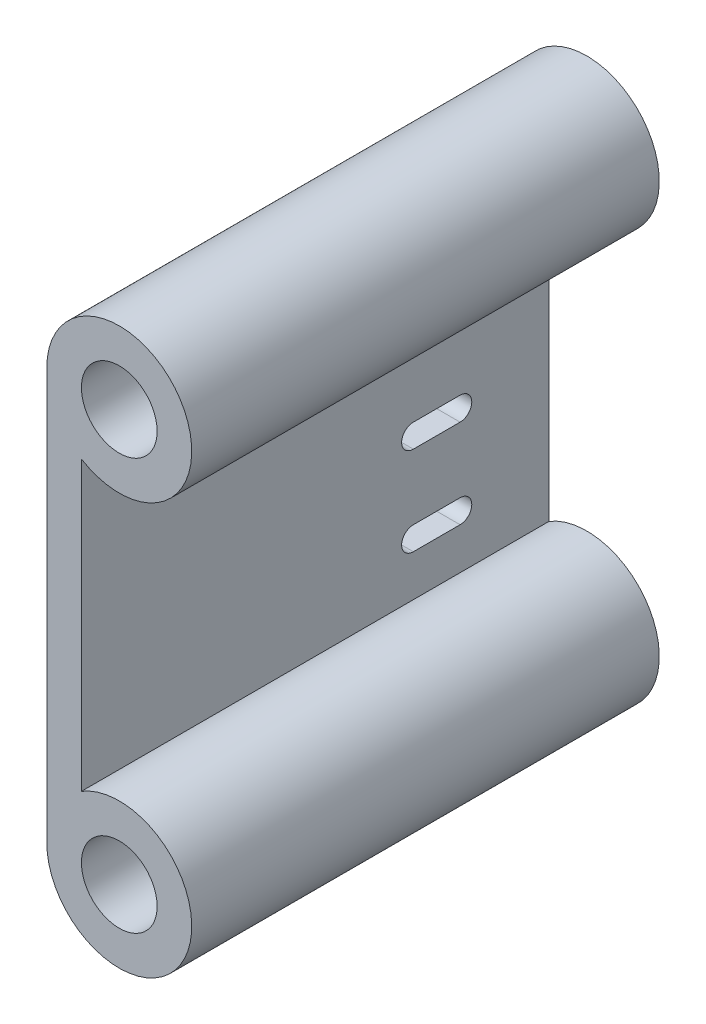
ISO-10303-21;
HEADER;
FILE_DESCRIPTION(('STEP AP214'),'2;1');
FILE_NAME('part.step','',(''),(''),'','','');
FILE_SCHEMA(('AUTOMOTIVE_DESIGN { 1 0 10303 214 1 1 1 1 }'));
ENDSEC;
DATA;
#1=APPLICATION_CONTEXT('core data for automotive mechanical design processes');
#2=APPLICATION_PROTOCOL_DEFINITION('international standard','automotive_design',2000,#1);
#3=PRODUCT_CONTEXT('',#1,'mechanical');
#4=PRODUCT('Part','Part','',(#3));
#5=PRODUCT_RELATED_PRODUCT_CATEGORY('part','',(#4));
#6=PRODUCT_DEFINITION_FORMATION('','',#4);
#7=PRODUCT_DEFINITION_CONTEXT('part definition',#1,'design');
#8=PRODUCT_DEFINITION('design','',#6,#7);
#9=PRODUCT_DEFINITION_SHAPE('','',#8);
#10=(LENGTH_UNIT() NAMED_UNIT(*) SI_UNIT(.MILLI.,.METRE.));
#11=(NAMED_UNIT(*) PLANE_ANGLE_UNIT() SI_UNIT($,.RADIAN.));
#12=(NAMED_UNIT(*) SI_UNIT($,.STERADIAN.) SOLID_ANGLE_UNIT());
#13=UNCERTAINTY_MEASURE_WITH_UNIT(LENGTH_MEASURE(1.E-05),#10,'distance_accuracy_value','');
#14=(GEOMETRIC_REPRESENTATION_CONTEXT(3) GLOBAL_UNCERTAINTY_ASSIGNED_CONTEXT((#13)) GLOBAL_UNIT_ASSIGNED_CONTEXT((#10,
#11,#12)) REPRESENTATION_CONTEXT('',''));
#15=CARTESIAN_POINT('',(0.,0.,0.));
#16=DIRECTION('',(0.,0.,1.));
#17=DIRECTION('',(1.,0.,0.));
#18=AXIS2_PLACEMENT_3D('',#15,#16,#17);
#19=CARTESIAN_POINT('',(0.,0.,0.));
#20=DIRECTION('',(0.,0.,1.));
#21=DIRECTION('',(1.,0.,0.));
#22=AXIS2_PLACEMENT_3D('',#19,#20,#21);
#23=CYLINDRICAL_SURFACE('',#22,4.05);
#24=CARTESIAN_POINT('',(0.,0.,0.));
#25=DIRECTION('',(0.,0.,1.));
#26=DIRECTION('',(1.,0.,0.));
#27=AXIS2_PLACEMENT_3D('',#24,#25,#26);
#28=CIRCLE('',#27,4.05);
#29=CARTESIAN_POINT('',(4.05,0.,0.));
#30=VERTEX_POINT('',#29);
#31=EDGE_CURVE('E123',#30,#30,#28,.F.);
#32=ORIENTED_EDGE('',*,*,#31,.T.);
#33=EDGE_LOOP('',(#32));
#34=FACE_BOUND('',#33,.T.);
#35=CARTESIAN_POINT('',(0.,0.,50.));
#36=DIRECTION('',(0.,0.,1.));
#37=DIRECTION('',(1.,0.,0.));
#38=AXIS2_PLACEMENT_3D('',#35,#36,#37);
#39=CIRCLE('',#38,4.05);
#40=CARTESIAN_POINT('',(4.05,0.,50.));
#41=VERTEX_POINT('',#40);
#42=EDGE_CURVE('E237',#41,#41,#39,.F.);
#43=ORIENTED_EDGE('',*,*,#42,.F.);
#44=EDGE_LOOP('',(#43));
#45=FACE_BOUND('',#44,.T.);
#46=ADVANCED_FACE('F17',(#34,#45),#23,.F.);
#47=CARTESIAN_POINT('',(0.,44.,0.));
#48=DIRECTION('',(0.,0.,1.));
#49=DIRECTION('',(1.,0.,0.));
#50=AXIS2_PLACEMENT_3D('',#47,#48,#49);
#51=CYLINDRICAL_SURFACE('',#50,4.05);
#52=CARTESIAN_POINT('',(-4.05,44.,6.40000007450566));
#53=CARTESIAN_POINT('',(-4.04999685223553,44.0761169154431,6.39999578870728));
#54=CARTESIAN_POINT('',(-4.04783097813708,44.152310196124,6.3937633285609));
#55=CARTESIAN_POINT('',(-4.03938898231039,44.302523157684,6.36904840674091));
#56=CARTESIAN_POINT('',(-4.03310618301853,44.3765391028282,6.35054604296139));
#57=CARTESIAN_POINT('',(-4.01711477680744,44.520089317173,6.30201133765992));
#58=CARTESIAN_POINT('',(-4.00741431144962,44.5896337767924,6.27200638276647));
#59=CARTESIAN_POINT('',(-3.98557299108115,44.7226748682536,6.2014224514769));
#60=CARTESIAN_POINT('',(-3.97343243471679,44.7861722388072,6.16084476891238));
#61=CARTESIAN_POINT('',(-3.94747758634415,44.9076957527315,6.06868939262689));
#62=CARTESIAN_POINT('',(-3.93362098689811,44.9654689045886,6.01679006293415));
#63=CARTESIAN_POINT('',(-3.90601818656225,45.0717001206187,5.90413374601512));
#64=CARTESIAN_POINT('',(-3.89227203944133,45.1201538835565,5.8433726914209));
#65=CARTESIAN_POINT('',(-3.86597269034735,45.2078583696143,5.71238164297972));
#66=CARTESIAN_POINT('',(-3.85347113426405,45.2467685695701,5.64191249796702));
#67=CARTESIAN_POINT('',(-3.83174149246088,45.3120410855342,5.4949693055345));
#68=CARTESIAN_POINT('',(-3.82250929452894,45.3384191788538,5.41850295044667));
#69=CARTESIAN_POINT('',(-3.81057994755086,45.3719297188211,5.28475158859742));
#70=CARTESIAN_POINT('',(-3.80676155955979,45.3824333932344,5.22838944573788));
#71=CARTESIAN_POINT('',(-3.80163494659048,45.3964697375384,5.11469185679815));
#72=CARTESIAN_POINT('',(-3.80032646149114,45.4000031298156,5.05735651219996));
#73=CARTESIAN_POINT('',(-3.80033164722378,45.3999973765664,4.92398386059424));
#74=CARTESIAN_POINT('',(-3.80263687398016,45.3937833484232,4.84793059666169));
#75=CARTESIAN_POINT('',(-3.8115687030374,45.3691631615223,4.69804989776809));
#76=CARTESIAN_POINT('',(-3.81819920175619,45.3507460093539,4.62422453260793));
#77=CARTESIAN_POINT('',(-3.83493841573668,45.3024567037844,4.48105646999839));
#78=CARTESIAN_POINT('',(-3.84503878477827,45.2726120179367,4.41170348607359));
#79=CARTESIAN_POINT('',(-3.8675683395875,45.2024013849241,4.27897808168668));
#80=CARTESIAN_POINT('',(-3.87999770937496,45.1620346062852,4.21560613439569));
#81=CARTESIAN_POINT('',(-3.90637263087285,45.0701033305774,4.0939579057192));
#82=CARTESIAN_POINT('',(-3.92035798902173,45.0181696168376,4.03596920538395));
#83=CARTESIAN_POINT('',(-3.94793676951293,44.9053525665783,3.92931537252116));
#84=CARTESIAN_POINT('',(-3.96153004921608,44.844466020916,3.88065359769789));
#85=CARTESIAN_POINT('',(-3.98725955815956,44.7133359892384,3.79270478203553));
#86=CARTESIAN_POINT('',(-3.99934283085323,44.642874261265,3.75372656581084));
#87=CARTESIAN_POINT('',(-4.02020162781259,44.4959438702756,3.68832591296955));
#88=CARTESIAN_POINT('',(-4.02898111016953,44.4194825287126,3.66188844200673));
#89=CARTESIAN_POINT('',(-4.0403058923016,44.285580847822,3.62823546743202));
#90=CARTESIAN_POINT('',(-4.04392056567709,44.2290507238544,3.61766961393945));
#91=CARTESIAN_POINT('',(-4.04876840174669,44.1150208919387,3.60355101418601));
#92=CARTESIAN_POINT('',(-4.05000176228075,44.0575212649375,3.59999768532263));
#93=CARTESIAN_POINT('',(-4.04999766637236,43.9238313640928,3.60000323828298));
#94=CARTESIAN_POINT('',(-4.04782950944643,43.8476252794954,3.60624145568799));
#95=CARTESIAN_POINT('',(-4.03938397857652,43.6974263452717,3.6309664828758));
#96=CARTESIAN_POINT('',(-4.03310310067805,43.6234354391942,3.64946373727168));
#97=CARTESIAN_POINT('',(-4.01711568401073,43.4799166198045,3.69798666813733));
#98=CARTESIAN_POINT('',(-4.00741628460458,43.4103797594552,3.72798832979406));
#99=CARTESIAN_POINT('',(-3.98557542228506,43.2773384207667,3.79857029284505));
#100=CARTESIAN_POINT('',(-3.97343379401156,43.2138343513288,3.83915131060884));
#101=CARTESIAN_POINT('',(-3.94747646917646,43.0922987832283,3.93131596294029));
#102=CARTESIAN_POINT('',(-3.93361845178673,43.0345203675302,3.98322135015564));
#103=CARTESIAN_POINT('',(-3.90601568363352,42.9282912204588,4.09587848068023));
#104=CARTESIAN_POINT('',(-3.89227096355391,42.8798429413103,4.1566325423233));
#105=CARTESIAN_POINT('',(-3.86597926347177,42.7921631249805,4.28759002788115));
#106=CARTESIAN_POINT('',(-3.85348329977152,42.7532679019584,4.35802986523984));
#107=CARTESIAN_POINT('',(-3.83175033457629,42.6879855322925,4.50495255952235));
#108=CARTESIAN_POINT('',(-3.82251225191318,42.6615942350655,4.58143340133162));
#109=CARTESIAN_POINT('',(-3.80878771033206,42.6230308131196,4.73538287131657));
#110=CARTESIAN_POINT('',(-3.80414270968107,42.6103826417163,4.81271768320893));
#111=CARTESIAN_POINT('',(-3.79966260617366,42.5981760252436,4.96854068575665));
#112=CARTESIAN_POINT('',(-3.79982588301893,42.5986131706715,5.04702847896805));
#113=CARTESIAN_POINT('',(-3.80480558029733,42.6121967831184,5.19878898974904));
#114=CARTESIAN_POINT('',(-3.8093906501622,42.624711374584,5.27212719823853));
#115=CARTESIAN_POINT('',(-3.82231708835913,42.6610600047607,5.41559082677608));
#116=CARTESIAN_POINT('',(-3.83065895328935,42.6848955399723,5.48571582072948));
#117=CARTESIAN_POINT('',(-3.85031665178377,42.7436041513435,5.622156635458));
#118=CARTESIAN_POINT('',(-3.86168061440899,42.7786579102992,5.68838747469445));
#119=CARTESIAN_POINT('',(-3.88608233108324,42.8586805946603,5.81421856582217));
#120=CARTESIAN_POINT('',(-3.89912051137582,42.9036520471369,5.87381712194504));
#121=CARTESIAN_POINT('',(-3.92629899886822,43.0052197427307,5.9882234995546));
#122=CARTESIAN_POINT('',(-3.940460038631,43.0623277399675,6.04257300221764));
#123=CARTESIAN_POINT('',(-3.96765517614712,43.1850417380167,6.14106669045207));
#124=CARTESIAN_POINT('',(-3.98068877241124,43.2506514883439,6.18520634912774));
#125=CARTESIAN_POINT('',(-4.00435717518212,43.3895537193438,6.26243664327962));
#126=CARTESIAN_POINT('',(-4.01496117578511,43.462929268156,6.29538769322378));
#127=CARTESIAN_POINT('',(-4.03233492090034,43.6145602094571,6.34827884976521));
#128=CARTESIAN_POINT('',(-4.03911248668647,43.6928052822355,6.36824550938214));
#129=CARTESIAN_POINT('',(-4.04570925946102,43.8098202505318,6.3875483339678));
#130=CARTESIAN_POINT('',(-4.04731327443164,43.8476813713629,6.39221162609059));
#131=CARTESIAN_POINT('',(-4.04945943496983,43.9236885948451,6.39843857408157));
#132=CARTESIAN_POINT('',(-4.0500015783007,43.9618346980962,6.40000222342076));
#133=CARTESIAN_POINT('',(-4.05,44.,6.40000007450566));
#134=B_SPLINE_CURVE_WITH_KNOTS('',3,(#52,#53,#54,#55,#56,#57,#58,#59,#60,#61,#62,#63,#64,#65,
#66,#67,#68,#69,#70,#71,#72,#73,#74,#75,#76,#77,#78,#79,#80,#81,#82,#83,#84,#85,#86,#87,#88,#89,
#90,#91,#92,#93,#94,#95,#96,#97,#98,#99,#100,#101,#102,#103,#104,#105,#106,#107,#108,#109,#110,
#111,#112,#113,#114,#115,#116,#117,#118,#119,#120,#121,#122,#123,#124,#125,#126,#127,#128,#129,
#130,#131,#132,#133),.UNSPECIFIED.,.T.,.F.,(4,2,2,2,2,2,2,2,2,2,2,2,2,2,2,2,2,2,2,2,2,2,2,2,2,2,
2,2,2,2,2,2,2,2,2,2,2,2,2,2,4),(0.,0.228203326274415,0.456777712674029,0.684811230576399,
0.912816856100757,1.14842418780841,1.38414000124577,1.62732985131523,1.87021272055387,
2.04213576554471,2.214040991828,2.44187216438703,2.66990886244503,2.89740085110306,
3.1249108220232,3.36112201305984,3.59741808134075,3.84048977815109,4.08326932979579,
4.25568206420645,4.42808047391539,4.6563719488531,4.88485817699031,5.11287002657384,
5.34089731974239,5.57652796253153,5.81222045147029,6.05529715356505,6.29829311156972,
6.53257356333543,6.76677506793681,6.98935250590233,7.21195937427412,7.43834910260226,
7.66479658279812,7.90398698171452,8.1432832317354,8.38546370513397,8.62714735001446,
8.74156909775226,8.85599108650484),.UNSPECIFIED.);
#135=CARTESIAN_POINT('',(-4.05,44.,6.40000007450566));
#136=VERTEX_POINT('',#135);
#137=EDGE_CURVE('E20',#136,#136,#134,.T.);
#138=ORIENTED_EDGE('',*,*,#137,.T.);
#139=EDGE_LOOP('',(#138));
#140=FACE_BOUND('',#139,.T.);
#141=CARTESIAN_POINT('',(0.,44.,0.));
#142=DIRECTION('',(0.,0.,1.));
#143=DIRECTION('',(1.,0.,0.));
#144=AXIS2_PLACEMENT_3D('',#141,#142,#143);
#145=CIRCLE('',#144,4.05);
#146=CARTESIAN_POINT('',(4.05,44.,0.));
#147=VERTEX_POINT('',#146);
#148=EDGE_CURVE('E137',#147,#147,#145,.F.);
#149=ORIENTED_EDGE('',*,*,#148,.T.);
#150=EDGE_LOOP('',(#149));
#151=FACE_BOUND('',#150,.T.);
#152=CARTESIAN_POINT('',(0.,44.,50.));
#153=DIRECTION('',(0.,0.,1.));
#154=DIRECTION('',(1.,0.,0.));
#155=AXIS2_PLACEMENT_3D('',#152,#153,#154);
#156=CIRCLE('',#155,4.05);
#157=CARTESIAN_POINT('',(4.05,44.,50.));
#158=VERTEX_POINT('',#157);
#159=EDGE_CURVE('E216',#158,#158,#156,.F.);
#160=ORIENTED_EDGE('',*,*,#159,.F.);
#161=EDGE_LOOP('',(#160));
#162=FACE_BOUND('',#161,.T.);
#163=ADVANCED_FACE('F222',(#140,#151,#162),#51,.F.);
#164=CARTESIAN_POINT('',(-4.05,6.60757141467272,0.));
#165=DIRECTION('',(1.,0.,0.));
#166=DIRECTION('',(0.,1.,0.));
#167=AXIS2_PLACEMENT_3D('',#164,#165,#166);
#168=PLANE('',#167);
#169=CARTESIAN_POINT('',(-4.05,21.8,14.5));
#170=DIRECTION('',(1.,0.,0.));
#171=DIRECTION('',(0.,0.,-1.));
#172=AXIS2_PLACEMENT_3D('',#169,#170,#171);
#173=CIRCLE('',#172,1.25);
#174=CARTESIAN_POINT('',(-4.05,20.55,14.5));
#175=VERTEX_POINT('',#174);
#176=CARTESIAN_POINT('',(-4.05,23.05,14.5));
#177=VERTEX_POINT('',#176);
#178=EDGE_CURVE('E286',#175,#177,#173,.F.);
#179=ORIENTED_EDGE('',*,*,#178,.T.);
#180=DIRECTION('',(0.,0.,1.));
#181=VECTOR('',#180,1.);
#182=CARTESIAN_POINT('',(-4.05,23.05,9.5));
#183=LINE('',#182,#181);
#184=CARTESIAN_POINT('',(-4.05,23.05,9.5));
#185=VERTEX_POINT('',#184);
#186=EDGE_CURVE('E256',#177,#185,#183,.F.);
#187=ORIENTED_EDGE('',*,*,#186,.T.);
#188=CARTESIAN_POINT('',(-4.05,21.8,9.5));
#189=DIRECTION('',(1.,0.,0.));
#190=DIRECTION('',(0.,0.,-1.));
#191=AXIS2_PLACEMENT_3D('',#188,#189,#190);
#192=CIRCLE('',#191,1.25);
#193=CARTESIAN_POINT('',(-4.05,20.55,9.5));
#194=VERTEX_POINT('',#193);
#195=EDGE_CURVE('E289',#185,#194,#192,.F.);
#196=ORIENTED_EDGE('',*,*,#195,.T.);
#197=DIRECTION('',(0.,0.,-1.));
#198=VECTOR('',#197,1.);
#199=CARTESIAN_POINT('',(-4.05,20.55,14.5));
#200=LINE('',#199,#198);
#201=EDGE_CURVE('E251',#194,#175,#200,.F.);
#202=ORIENTED_EDGE('',*,*,#201,.T.);
#203=EDGE_LOOP('',(#179,#187,#196,#202));
#204=FACE_BOUND('',#203,.T.);
#205=DIRECTION('',(0.,0.,1.));
#206=VECTOR('',#205,1.);
#207=CARTESIAN_POINT('',(-4.05,13.55,9.5));
#208=LINE('',#207,#206);
#209=CARTESIAN_POINT('',(-4.05,13.55,14.5));
#210=VERTEX_POINT('',#209);
#211=CARTESIAN_POINT('',(-4.05,13.55,9.5));
#212=VERTEX_POINT('',#211);
#213=EDGE_CURVE('E264',#210,#212,#208,.F.);
#214=ORIENTED_EDGE('',*,*,#213,.T.);
#215=CARTESIAN_POINT('',(-4.05,12.3,9.5));
#216=DIRECTION('',(1.,0.,0.));
#217=DIRECTION('',(0.,0.,-1.));
#218=AXIS2_PLACEMENT_3D('',#215,#216,#217);
#219=CIRCLE('',#218,1.25);
#220=CARTESIAN_POINT('',(-4.05,11.05,9.50000007092742));
#221=VERTEX_POINT('',#220);
#222=EDGE_CURVE('E295',#212,#221,#219,.F.);
#223=ORIENTED_EDGE('',*,*,#222,.T.);
#224=DIRECTION('',(0.,0.,-1.));
#225=VECTOR('',#224,1.);
#226=CARTESIAN_POINT('',(-4.05,11.05,14.5));
#227=LINE('',#226,#225);
#228=CARTESIAN_POINT('',(-4.05,11.05,14.5));
#229=VERTEX_POINT('',#228);
#230=EDGE_CURVE('E261',#221,#229,#227,.F.);
#231=ORIENTED_EDGE('',*,*,#230,.T.);
#232=CARTESIAN_POINT('',(-4.05,12.3,14.5));
#233=DIRECTION('',(1.,0.,0.));
#234=DIRECTION('',(0.,0.,-1.));
#235=AXIS2_PLACEMENT_3D('',#232,#233,#234);
#236=CIRCLE('',#235,1.25);
#237=EDGE_CURVE('E291',#229,#210,#236,.F.);
#238=ORIENTED_EDGE('',*,*,#237,.T.);
#239=EDGE_LOOP('',(#214,#223,#231,#238));
#240=FACE_BOUND('',#239,.T.);
#241=DIRECTION('',(0.,1.,0.));
#242=VECTOR('',#241,1.);
#243=CARTESIAN_POINT('',(-4.05,22.,50.));
#244=LINE('',#243,#242);
#245=CARTESIAN_POINT('',(-4.05,6.60757141467272,50.));
#246=VERTEX_POINT('',#245);
#247=CARTESIAN_POINT('',(-4.05000000000001,37.3924285853273,50.));
#248=VERTEX_POINT('',#247);
#249=EDGE_CURVE('E128',#246,#248,#244,.T.);
#250=ORIENTED_EDGE('',*,*,#249,.F.);
#251=DIRECTION('',(0.,0.,1.));
#252=VECTOR('',#251,1.);
#253=CARTESIAN_POINT('',(-4.05,6.60757141467272,0.));
#254=LINE('',#253,#252);
#255=CARTESIAN_POINT('',(-4.05,6.60757141467272,0.));
#256=VERTEX_POINT('',#255);
#257=EDGE_CURVE('E126',#256,#246,#254,.T.);
#258=ORIENTED_EDGE('',*,*,#257,.F.);
#259=DIRECTION('',(0.,1.,0.));
#260=VECTOR('',#259,1.);
#261=CARTESIAN_POINT('',(-4.05,22.,0.));
#262=LINE('',#261,#260);
#263=CARTESIAN_POINT('',(-4.05000000000001,37.3924285853273,0.));
#264=VERTEX_POINT('',#263);
#265=EDGE_CURVE('E112',#256,#264,#262,.T.);
#266=ORIENTED_EDGE('',*,*,#265,.T.);
#267=DIRECTION('',(0.,0.,1.));
#268=VECTOR('',#267,1.);
#269=CARTESIAN_POINT('',(-4.05000000000002,37.3924285853273,0.));
#270=LINE('',#269,#268);
#271=EDGE_CURVE('E269',#248,#264,#270,.F.);
#272=ORIENTED_EDGE('',*,*,#271,.F.);
#273=EDGE_LOOP('',(#250,#258,#266,#272));
#274=FACE_BOUND('',#273,.T.);
#275=ADVANCED_FACE('F127',(#204,#240,#274),#168,.T.);
#276=CARTESIAN_POINT('',(-7.75,44.0000006556511,5.00000007450581));
#277=DIRECTION('',(1.,0.,0.));
#278=DIRECTION('',(0.,0.,-1.));
#279=AXIS2_PLACEMENT_3D('',#276,#277,#278);
#280=CYLINDRICAL_SURFACE('',#279,1.4);
#281=ORIENTED_EDGE('',*,*,#137,.F.);
#282=EDGE_LOOP('',(#281));
#283=FACE_BOUND('',#282,.T.);
#284=CARTESIAN_POINT('',(-7.74999999999997,44.0000006556511,3.60000007450581));
#285=CARTESIAN_POINT('',(-7.75000163332651,44.0390507740421,3.59999996730426));
#286=CARTESIAN_POINT('',(-7.7497044809315,44.0780818829179,3.60163494330092));
#287=CARTESIAN_POINT('',(-7.74852999224199,44.1558587405812,3.60815510646484));
#288=CARTESIAN_POINT('',(-7.74765271741939,44.1946045191636,3.6130399492646));
#289=CARTESIAN_POINT('',(-7.74418187563809,44.3098830674104,3.63251077183472));
#290=CARTESIAN_POINT('',(-7.74074913766204,44.3856340414793,3.65191325476569));
#291=CARTESIAN_POINT('',(-7.73202035041164,44.5327364587258,3.7029785719485));
#292=CARTESIAN_POINT('',(-7.72672394361262,44.6040870546496,3.73464375878444));
#293=CARTESIAN_POINT('',(-7.71484811274017,44.740476984973,3.80931260609129));
#294=CARTESIAN_POINT('',(-7.7082686382479,44.8055160712079,3.85231671215453));
#295=CARTESIAN_POINT('',(-7.69447303227453,44.928136013143,3.9489438867453));
#296=CARTESIAN_POINT('',(-7.68725125566839,44.9856368809952,4.00266761891991));
#297=CARTESIAN_POINT('',(-7.67302647777306,45.0908669002986,4.11899882911539));
#298=CARTESIAN_POINT('',(-7.66602351193136,45.1385944753543,4.18160773752891));
#299=CARTESIAN_POINT('',(-7.65297473084946,45.2232465512649,4.31449298826694));
#300=CARTESIAN_POINT('',(-7.64693626511293,45.2600897644236,4.38482189703794));
#301=CARTESIAN_POINT('',(-7.63658041474171,45.3214055207779,4.53079415806444));
#302=CARTESIAN_POINT('',(-7.63226279574607,45.3458797486188,4.60643678499668));
#303=CARTESIAN_POINT('',(-7.62589418884795,45.3815082691752,4.76003161237399));
#304=CARTESIAN_POINT('',(-7.62381933778356,45.3928028983628,4.83795025099811));
#305=CARTESIAN_POINT('',(-7.62209915903861,45.4021871206671,4.99460401485561));
#306=CARTESIAN_POINT('',(-7.6224536866789,45.4002775001493,5.07333909118806));
#307=CARTESIAN_POINT('',(-7.62553054781674,45.3834209153089,5.22837503175146));
#308=CARTESIAN_POINT('',(-7.62822395336246,45.3686332244792,5.30469387183822));
#309=CARTESIAN_POINT('',(-7.63562968436009,45.3266908998524,5.45374871639471));
#310=CARTESIAN_POINT('',(-7.64034207639277,45.2995358582113,5.52648460262002));
#311=CARTESIAN_POINT('',(-7.65128549522958,45.2334714812984,5.66678025108302));
#312=CARTESIAN_POINT('',(-7.65752489917002,45.194497012946,5.73430866197575));
#313=CARTESIAN_POINT('',(-7.6708133959302,45.1059475346941,5.86192483980578));
#314=CARTESIAN_POINT('',(-7.67786253665896,45.0563718974142,5.92201216604502));
#315=CARTESIAN_POINT('',(-7.69210194651807,44.9471730180487,6.03395687016239));
#316=CARTESIAN_POINT('',(-7.69929278077602,44.8874146244469,6.08568241415835));
#317=CARTESIAN_POINT('',(-7.71291338525928,44.7599775848035,6.17840766875535));
#318=CARTESIAN_POINT('',(-7.71934294404457,44.6922967486791,6.21940440329783));
#319=CARTESIAN_POINT('',(-7.73072909483259,44.5507937572343,6.28952565392317));
#320=CARTESIAN_POINT('',(-7.73568322215659,44.4769615865537,6.31863033439403));
#321=CARTESIAN_POINT('',(-7.74353579955546,44.3253965376891,6.36394760355714));
#322=CARTESIAN_POINT('',(-7.74643730062476,44.2476696335236,6.38017933078975));
#323=CARTESIAN_POINT('',(-7.74876672354743,44.1411163719226,6.3931590079258));
#324=CARTESIAN_POINT('',(-7.74922879341829,44.1129311965145,6.39572543321956));
#325=CARTESIAN_POINT('',(-7.7498451328302,44.0565015056763,6.39914376703911));
#326=CARTESIAN_POINT('',(-7.74999992139897,44.0282571711138,6.39999856668674));
#327=CARTESIAN_POINT('',(-7.75,44.,6.40000007450566));
#328=B_SPLINE_CURVE_WITH_KNOTS('',3,(#284,#285,#286,#287,#288,#289,#290,#291,#292,#293,#294,
#295,#296,#297,#298,#299,#300,#301,#302,#303,#304,#305,#306,#307,#308,#309,#310,#311,#312,#313,
#314,#315,#316,#317,#318,#319,#320,#321,#322,#323,#324,#325,#326,#327),.UNSPECIFIED.,.F.,.F.,(4,
2,2,2,2,2,2,2,2,2,2,2,2,2,2,2,2,2,2,2,2,4),(0.,0.11707742720318,0.234142450438963,
0.467748363593503,0.701399115964451,0.935059051618604,1.17102625871617,1.40703149651104,
1.64475714775861,1.88245041224101,2.11758892982253,2.35271344409392,2.58497063126401,
2.81723547824407,3.05080426659683,3.28438688144635,3.52135331165138,3.75838540433763,
3.99581126161949,4.23288346675352,4.31775950203243,4.40249205111236),.UNSPECIFIED.);
#329=CARTESIAN_POINT('',(-7.74999999999999,44.0000006556511,3.60000007450581));
#330=VERTEX_POINT('',#329);
#331=CARTESIAN_POINT('',(-7.75,44.,6.40000007450566));
#332=VERTEX_POINT('',#331);
#333=EDGE_CURVE('E207',#330,#332,#328,.T.);
#334=ORIENTED_EDGE('',*,*,#333,.F.);
#335=CARTESIAN_POINT('',(-7.75,44.0000006556511,5.00000007450581));
#336=DIRECTION('',(1.,0.,0.));
#337=DIRECTION('',(0.,0.,-1.));
#338=AXIS2_PLACEMENT_3D('',#335,#336,#337);
#339=CIRCLE('',#338,1.4);
#340=EDGE_CURVE('E254',#332,#330,#339,.T.);
#341=ORIENTED_EDGE('',*,*,#340,.F.);
#342=EDGE_LOOP('',(#334,#341));
#343=FACE_BOUND('',#342,.T.);
#344=ADVANCED_FACE('F149',(#283,#343),#280,.F.);
#345=CARTESIAN_POINT('',(0.,22.,0.));
#346=DIRECTION('',(0.,0.,1.));
#347=DIRECTION('',(1.,0.,0.));
#348=AXIS2_PLACEMENT_3D('',#345,#346,#347);
#349=PLANE('',#348);
#350=ORIENTED_EDGE('',*,*,#148,.F.);
#351=EDGE_LOOP('',(#350));
#352=FACE_BOUND('',#351,.T.);
#353=ORIENTED_EDGE('',*,*,#31,.F.);
#354=EDGE_LOOP('',(#353));
#355=FACE_BOUND('',#354,.T.);
#356=DIRECTION('',(0.,-1.,0.));
#357=VECTOR('',#356,1.);
#358=CARTESIAN_POINT('',(-7.75,44.,0.));
#359=LINE('',#358,#357);
#360=CARTESIAN_POINT('',(-7.75,44.0000003278255,0.));
#361=VERTEX_POINT('',#360);
#362=CARTESIAN_POINT('',(-7.75,0.,0.));
#363=VERTEX_POINT('',#362);
#364=EDGE_CURVE('E248',#361,#363,#359,.T.);
#365=ORIENTED_EDGE('',*,*,#364,.F.);
#366=CARTESIAN_POINT('',(0.,44.,0.));
#367=DIRECTION('',(0.,0.,1.));
#368=DIRECTION('',(1.,0.,0.));
#369=AXIS2_PLACEMENT_3D('',#366,#367,#368);
#370=CIRCLE('',#369,7.75);
#371=EDGE_CURVE('E119',#264,#361,#370,.T.);
#372=ORIENTED_EDGE('',*,*,#371,.F.);
#373=ORIENTED_EDGE('',*,*,#265,.F.);
#374=CARTESIAN_POINT('',(0.,0.,0.));
#375=DIRECTION('',(0.,0.,1.));
#376=DIRECTION('',(1.,0.,0.));
#377=AXIS2_PLACEMENT_3D('',#374,#375,#376);
#378=CIRCLE('',#377,7.75);
#379=EDGE_CURVE('E117',#363,#256,#378,.T.);
#380=ORIENTED_EDGE('',*,*,#379,.F.);
#381=EDGE_LOOP('',(#365,#372,#373,#380));
#382=FACE_BOUND('',#381,.T.);
#383=ADVANCED_FACE('F115',(#352,#355,#382),#349,.F.);
#384=CARTESIAN_POINT('',(0.,0.,0.));
#385=DIRECTION('',(0.,0.,1.));
#386=DIRECTION('',(1.,0.,0.));
#387=AXIS2_PLACEMENT_3D('',#384,#385,#386);
#388=CYLINDRICAL_SURFACE('',#387,7.75);
#389=CARTESIAN_POINT('',(0.,0.,50.));
#390=DIRECTION('',(0.,0.,1.));
#391=DIRECTION('',(1.,0.,0.));
#392=AXIS2_PLACEMENT_3D('',#389,#390,#391);
#393=CIRCLE('',#392,7.75);
#394=CARTESIAN_POINT('',(-7.75,0.,50.));
#395=VERTEX_POINT('',#394);
#396=EDGE_CURVE('E131',#395,#246,#393,.T.);
#397=ORIENTED_EDGE('',*,*,#396,.F.);
#398=DIRECTION('',(0.,0.,1.));
#399=VECTOR('',#398,1.);
#400=CARTESIAN_POINT('',(-7.75,0.,0.));
#401=LINE('',#400,#399);
#402=EDGE_CURVE('E135',#363,#395,#401,.T.);
#403=ORIENTED_EDGE('',*,*,#402,.F.);
#404=ORIENTED_EDGE('',*,*,#379,.T.);
#405=ORIENTED_EDGE('',*,*,#257,.T.);
#406=EDGE_LOOP('',(#397,#403,#404,#405));
#407=FACE_BOUND('',#406,.T.);
#408=ADVANCED_FACE('F133',(#407),#388,.T.);
#409=CARTESIAN_POINT('',(0.,22.,50.));
#410=DIRECTION('',(0.,0.,1.));
#411=DIRECTION('',(1.,0.,0.));
#412=AXIS2_PLACEMENT_3D('',#409,#410,#411);
#413=PLANE('',#412);
#414=ORIENTED_EDGE('',*,*,#159,.T.);
#415=EDGE_LOOP('',(#414));
#416=FACE_BOUND('',#415,.T.);
#417=ORIENTED_EDGE('',*,*,#42,.T.);
#418=EDGE_LOOP('',(#417));
#419=FACE_BOUND('',#418,.T.);
#420=CARTESIAN_POINT('',(0.,44.,50.));
#421=DIRECTION('',(0.,0.,1.));
#422=DIRECTION('',(1.,0.,0.));
#423=AXIS2_PLACEMENT_3D('',#420,#421,#422);
#424=CIRCLE('',#423,7.75);
#425=CARTESIAN_POINT('',(-7.75,44.,50.));
#426=VERTEX_POINT('',#425);
#427=EDGE_CURVE('E215',#426,#248,#424,.F.);
#428=ORIENTED_EDGE('',*,*,#427,.F.);
#429=DIRECTION('',(0.,-1.,0.));
#430=VECTOR('',#429,1.);
#431=CARTESIAN_POINT('',(-7.75,44.,50.));
#432=LINE('',#431,#430);
#433=EDGE_CURVE('E245',#395,#426,#432,.F.);
#434=ORIENTED_EDGE('',*,*,#433,.F.);
#435=ORIENTED_EDGE('',*,*,#396,.T.);
#436=ORIENTED_EDGE('',*,*,#249,.T.);
#437=EDGE_LOOP('',(#428,#434,#435,#436));
#438=FACE_BOUND('',#437,.T.);
#439=ADVANCED_FACE('F157',(#416,#419,#438),#413,.T.);
#440=CARTESIAN_POINT('',(0.,44.,0.));
#441=DIRECTION('',(0.,0.,1.));
#442=DIRECTION('',(1.,0.,0.));
#443=AXIS2_PLACEMENT_3D('',#440,#441,#442);
#444=CYLINDRICAL_SURFACE('',#443,7.75);
#445=ORIENTED_EDGE('',*,*,#371,.T.);
#446=DIRECTION('',(0.,0.,1.));
#447=VECTOR('',#446,1.);
#448=CARTESIAN_POINT('',(-7.75,44.0000006556511,0.));
#449=LINE('',#448,#447);
#450=EDGE_CURVE('E249',#330,#361,#449,.F.);
#451=ORIENTED_EDGE('',*,*,#450,.F.);
#452=ORIENTED_EDGE('',*,*,#333,.T.);
#453=DIRECTION('',(0.,0.,1.));
#454=VECTOR('',#453,1.);
#455=CARTESIAN_POINT('',(-7.75,44.,0.));
#456=LINE('',#455,#454);
#457=EDGE_CURVE('E306',#426,#332,#456,.F.);
#458=ORIENTED_EDGE('',*,*,#457,.F.);
#459=ORIENTED_EDGE('',*,*,#427,.T.);
#460=ORIENTED_EDGE('',*,*,#271,.T.);
#461=EDGE_LOOP('',(#445,#451,#452,#458,#459,#460));
#462=FACE_BOUND('',#461,.T.);
#463=ADVANCED_FACE('F200',(#462),#444,.T.);
#464=CARTESIAN_POINT('',(-7.75,11.05,14.5));
#465=DIRECTION('',(0.,-1.,0.));
#466=DIRECTION('',(0.,0.,-1.));
#467=AXIS2_PLACEMENT_3D('',#464,#465,#466);
#468=PLANE('',#467);
#469=DIRECTION('',(1.,0.,0.));
#470=VECTOR('',#469,1.);
#471=CARTESIAN_POINT('',(-7.75,11.05,9.50000014185483));
#472=LINE('',#471,#470);
#473=CARTESIAN_POINT('',(-7.75,11.05,9.50000007092742));
#474=VERTEX_POINT('',#473);
#475=EDGE_CURVE('E263',#221,#474,#472,.F.);
#476=ORIENTED_EDGE('',*,*,#475,.T.);
#477=DIRECTION('',(0.,0.,1.));
#478=VECTOR('',#477,1.);
#479=CARTESIAN_POINT('',(-7.75,11.05,0.));
#480=LINE('',#479,#478);
#481=CARTESIAN_POINT('',(-7.75,11.05,14.5));
#482=VERTEX_POINT('',#481);
#483=EDGE_CURVE('E283',#482,#474,#480,.F.);
#484=ORIENTED_EDGE('',*,*,#483,.F.);
#485=DIRECTION('',(1.,0.,0.));
#486=VECTOR('',#485,1.);
#487=CARTESIAN_POINT('',(-7.75,11.05,14.5));
#488=LINE('',#487,#486);
#489=EDGE_CURVE('E294',#482,#229,#488,.T.);
#490=ORIENTED_EDGE('',*,*,#489,.T.);
#491=ORIENTED_EDGE('',*,*,#230,.F.);
#492=EDGE_LOOP('',(#476,#484,#490,#491));
#493=FACE_BOUND('',#492,.T.);
#494=ADVANCED_FACE('F196',(#493),#468,.F.);
#495=CARTESIAN_POINT('',(-7.75,12.3,9.5));
#496=DIRECTION('',(1.,0.,0.));
#497=DIRECTION('',(0.,0.,-1.));
#498=AXIS2_PLACEMENT_3D('',#495,#496,#497);
#499=CYLINDRICAL_SURFACE('',#498,1.25);
#500=DIRECTION('',(1.,0.,0.));
#501=VECTOR('',#500,1.);
#502=CARTESIAN_POINT('',(-7.75,13.55,9.5));
#503=LINE('',#502,#501);
#504=CARTESIAN_POINT('',(-7.75,13.55,9.5));
#505=VERTEX_POINT('',#504);
#506=EDGE_CURVE('E268',#212,#505,#503,.F.);
#507=ORIENTED_EDGE('',*,*,#506,.T.);
#508=CARTESIAN_POINT('',(-7.75,12.3,9.5));
#509=DIRECTION('',(1.,0.,0.));
#510=DIRECTION('',(0.,0.,-1.));
#511=AXIS2_PLACEMENT_3D('',#508,#509,#510);
#512=CIRCLE('',#511,1.25);
#513=EDGE_CURVE('E280',#474,#505,#512,.T.);
#514=ORIENTED_EDGE('',*,*,#513,.F.);
#515=ORIENTED_EDGE('',*,*,#475,.F.);
#516=ORIENTED_EDGE('',*,*,#222,.F.);
#517=EDGE_LOOP('',(#507,#514,#515,#516));
#518=FACE_BOUND('',#517,.T.);
#519=ADVANCED_FACE('F192',(#518),#499,.F.);
#520=CARTESIAN_POINT('',(-7.75,13.55,9.5));
#521=DIRECTION('',(0.,1.,0.));
#522=DIRECTION('',(0.,0.,1.));
#523=AXIS2_PLACEMENT_3D('',#520,#521,#522);
#524=PLANE('',#523);
#525=DIRECTION('',(1.,0.,0.));
#526=VECTOR('',#525,1.);
#527=CARTESIAN_POINT('',(-7.75,13.55,14.5));
#528=LINE('',#527,#526);
#529=CARTESIAN_POINT('',(-7.75,13.55,14.5));
#530=VERTEX_POINT('',#529);
#531=EDGE_CURVE('E267',#210,#530,#528,.F.);
#532=ORIENTED_EDGE('',*,*,#531,.T.);
#533=DIRECTION('',(0.,0.,1.));
#534=VECTOR('',#533,1.);
#535=CARTESIAN_POINT('',(-7.75,13.55,0.));
#536=LINE('',#535,#534);
#537=EDGE_CURVE('E279',#505,#530,#536,.T.);
#538=ORIENTED_EDGE('',*,*,#537,.F.);
#539=ORIENTED_EDGE('',*,*,#506,.F.);
#540=ORIENTED_EDGE('',*,*,#213,.F.);
#541=EDGE_LOOP('',(#532,#538,#539,#540));
#542=FACE_BOUND('',#541,.T.);
#543=ADVANCED_FACE('F188',(#542),#524,.F.);
#544=CARTESIAN_POINT('',(-7.75,12.3,14.5));
#545=DIRECTION('',(1.,0.,0.));
#546=DIRECTION('',(0.,0.,-1.));
#547=AXIS2_PLACEMENT_3D('',#544,#545,#546);
#548=CYLINDRICAL_SURFACE('',#547,1.25);
#549=ORIENTED_EDGE('',*,*,#489,.F.);
#550=CARTESIAN_POINT('',(-7.75,12.3,14.5));
#551=DIRECTION('',(1.,0.,0.));
#552=DIRECTION('',(0.,0.,-1.));
#553=AXIS2_PLACEMENT_3D('',#550,#551,#552);
#554=CIRCLE('',#553,1.25);
#555=EDGE_CURVE('E276',#530,#482,#554,.T.);
#556=ORIENTED_EDGE('',*,*,#555,.F.);
#557=ORIENTED_EDGE('',*,*,#531,.F.);
#558=ORIENTED_EDGE('',*,*,#237,.F.);
#559=EDGE_LOOP('',(#549,#556,#557,#558));
#560=FACE_BOUND('',#559,.T.);
#561=ADVANCED_FACE('F184',(#560),#548,.F.);
#562=CARTESIAN_POINT('',(-7.75,21.8,9.5));
#563=DIRECTION('',(1.,0.,0.));
#564=DIRECTION('',(0.,0.,-1.));
#565=AXIS2_PLACEMENT_3D('',#562,#563,#564);
#566=CYLINDRICAL_SURFACE('',#565,1.25);
#567=DIRECTION('',(1.,0.,0.));
#568=VECTOR('',#567,1.);
#569=CARTESIAN_POINT('',(-7.75,23.05,9.5));
#570=LINE('',#569,#568);
#571=CARTESIAN_POINT('',(-7.75,23.05,9.5));
#572=VERTEX_POINT('',#571);
#573=EDGE_CURVE('E260',#185,#572,#570,.F.);
#574=ORIENTED_EDGE('',*,*,#573,.T.);
#575=CARTESIAN_POINT('',(-7.75,21.8,9.5));
#576=DIRECTION('',(1.,0.,0.));
#577=DIRECTION('',(0.,0.,-1.));
#578=AXIS2_PLACEMENT_3D('',#575,#576,#577);
#579=CIRCLE('',#578,1.25);
#580=CARTESIAN_POINT('',(-7.75,20.55,9.5));
#581=VERTEX_POINT('',#580);
#582=EDGE_CURVE('E273',#581,#572,#579,.T.);
#583=ORIENTED_EDGE('',*,*,#582,.F.);
#584=DIRECTION('',(1.,0.,0.));
#585=VECTOR('',#584,1.);
#586=CARTESIAN_POINT('',(-7.75,20.55,9.5));
#587=LINE('',#586,#585);
#588=EDGE_CURVE('E255',#581,#194,#587,.T.);
#589=ORIENTED_EDGE('',*,*,#588,.T.);
#590=ORIENTED_EDGE('',*,*,#195,.F.);
#591=EDGE_LOOP('',(#574,#583,#589,#590));
#592=FACE_BOUND('',#591,.T.);
#593=ADVANCED_FACE('F180',(#592),#566,.F.);
#594=CARTESIAN_POINT('',(-7.75,23.05,9.5));
#595=DIRECTION('',(0.,1.,0.));
#596=DIRECTION('',(0.,0.,1.));
#597=AXIS2_PLACEMENT_3D('',#594,#595,#596);
#598=PLANE('',#597);
#599=DIRECTION('',(1.,0.,0.));
#600=VECTOR('',#599,1.);
#601=CARTESIAN_POINT('',(-7.75,23.05,14.5));
#602=LINE('',#601,#600);
#603=CARTESIAN_POINT('',(-7.75,23.05,14.5));
#604=VERTEX_POINT('',#603);
#605=EDGE_CURVE('E259',#177,#604,#602,.F.);
#606=ORIENTED_EDGE('',*,*,#605,.T.);
#607=DIRECTION('',(0.,0.,1.));
#608=VECTOR('',#607,1.);
#609=CARTESIAN_POINT('',(-7.75,23.05,0.));
#610=LINE('',#609,#608);
#611=EDGE_CURVE('E272',#572,#604,#610,.T.);
#612=ORIENTED_EDGE('',*,*,#611,.F.);
#613=ORIENTED_EDGE('',*,*,#573,.F.);
#614=ORIENTED_EDGE('',*,*,#186,.F.);
#615=EDGE_LOOP('',(#606,#612,#613,#614));
#616=FACE_BOUND('',#615,.T.);
#617=ADVANCED_FACE('F177',(#616),#598,.F.);
#618=CARTESIAN_POINT('',(-7.75,21.8,14.5));
#619=DIRECTION('',(1.,0.,0.));
#620=DIRECTION('',(0.,0.,-1.));
#621=AXIS2_PLACEMENT_3D('',#618,#619,#620);
#622=CYLINDRICAL_SURFACE('',#621,1.25);
#623=DIRECTION('',(1.,0.,0.));
#624=VECTOR('',#623,1.);
#625=CARTESIAN_POINT('',(-7.75,20.55,14.5));
#626=LINE('',#625,#624);
#627=CARTESIAN_POINT('',(-7.75,20.55,14.5));
#628=VERTEX_POINT('',#627);
#629=EDGE_CURVE('E39',#175,#628,#626,.F.);
#630=ORIENTED_EDGE('',*,*,#629,.T.);
#631=CARTESIAN_POINT('',(-7.75,21.8,14.5));
#632=DIRECTION('',(1.,0.,0.));
#633=DIRECTION('',(0.,0.,-1.));
#634=AXIS2_PLACEMENT_3D('',#631,#632,#633);
#635=CIRCLE('',#634,1.25);
#636=EDGE_CURVE('E30',#604,#628,#635,.T.);
#637=ORIENTED_EDGE('',*,*,#636,.F.);
#638=ORIENTED_EDGE('',*,*,#605,.F.);
#639=ORIENTED_EDGE('',*,*,#178,.F.);
#640=EDGE_LOOP('',(#630,#637,#638,#639));
#641=FACE_BOUND('',#640,.T.);
#642=ADVANCED_FACE('F169',(#641),#622,.F.);
#643=CARTESIAN_POINT('',(-7.75,20.55,14.5));
#644=DIRECTION('',(0.,-1.,0.));
#645=DIRECTION('',(0.,0.,-1.));
#646=AXIS2_PLACEMENT_3D('',#643,#644,#645);
#647=PLANE('',#646);
#648=ORIENTED_EDGE('',*,*,#588,.F.);
#649=DIRECTION('',(0.,0.,1.));
#650=VECTOR('',#649,1.);
#651=CARTESIAN_POINT('',(-7.75,20.55,0.));
#652=LINE('',#651,#650);
#653=EDGE_CURVE('E11',#628,#581,#652,.F.);
#654=ORIENTED_EDGE('',*,*,#653,.F.);
#655=ORIENTED_EDGE('',*,*,#629,.F.);
#656=ORIENTED_EDGE('',*,*,#201,.F.);
#657=EDGE_LOOP('',(#648,#654,#655,#656));
#658=FACE_BOUND('',#657,.T.);
#659=ADVANCED_FACE('F163',(#658),#647,.F.);
#660=CARTESIAN_POINT('',(-7.75,44.,0.));
#661=DIRECTION('',(-1.,0.,0.));
#662=DIRECTION('',(0.,-1.,0.));
#663=AXIS2_PLACEMENT_3D('',#660,#661,#662);
#664=PLANE('',#663);
#665=ORIENTED_EDGE('',*,*,#636,.T.);
#666=ORIENTED_EDGE('',*,*,#653,.T.);
#667=ORIENTED_EDGE('',*,*,#582,.T.);
#668=ORIENTED_EDGE('',*,*,#611,.T.);
#669=EDGE_LOOP('',(#665,#666,#667,#668));
#670=FACE_BOUND('',#669,.T.);
#671=ORIENTED_EDGE('',*,*,#537,.T.);
#672=ORIENTED_EDGE('',*,*,#555,.T.);
#673=ORIENTED_EDGE('',*,*,#483,.T.);
#674=ORIENTED_EDGE('',*,*,#513,.T.);
#675=EDGE_LOOP('',(#671,#672,#673,#674));
#676=FACE_BOUND('',#675,.T.);
#677=ORIENTED_EDGE('',*,*,#433,.T.);
#678=ORIENTED_EDGE('',*,*,#457,.T.);
#679=ORIENTED_EDGE('',*,*,#340,.T.);
#680=ORIENTED_EDGE('',*,*,#450,.T.);
#681=ORIENTED_EDGE('',*,*,#364,.T.);
#682=ORIENTED_EDGE('',*,*,#402,.T.);
#683=EDGE_LOOP('',(#677,#678,#679,#680,#681,#682));
#684=FACE_BOUND('',#683,.T.);
#685=ADVANCED_FACE('F161',(#670,#676,#684),#664,.T.);
#686=CLOSED_SHELL('',(#46,#163,#275,#344,#383,#408,#439,#463,#494,#519,#543,#561,#593,#617,#642,
#659,#685));
#687=MANIFOLD_SOLID_BREP('B1',#686);
#688=ADVANCED_BREP_SHAPE_REPRESENTATION('',(#18,#687),#14);
#689=SHAPE_DEFINITION_REPRESENTATION(#9,#688);
ENDSEC;
END-ISO-10303-21;
